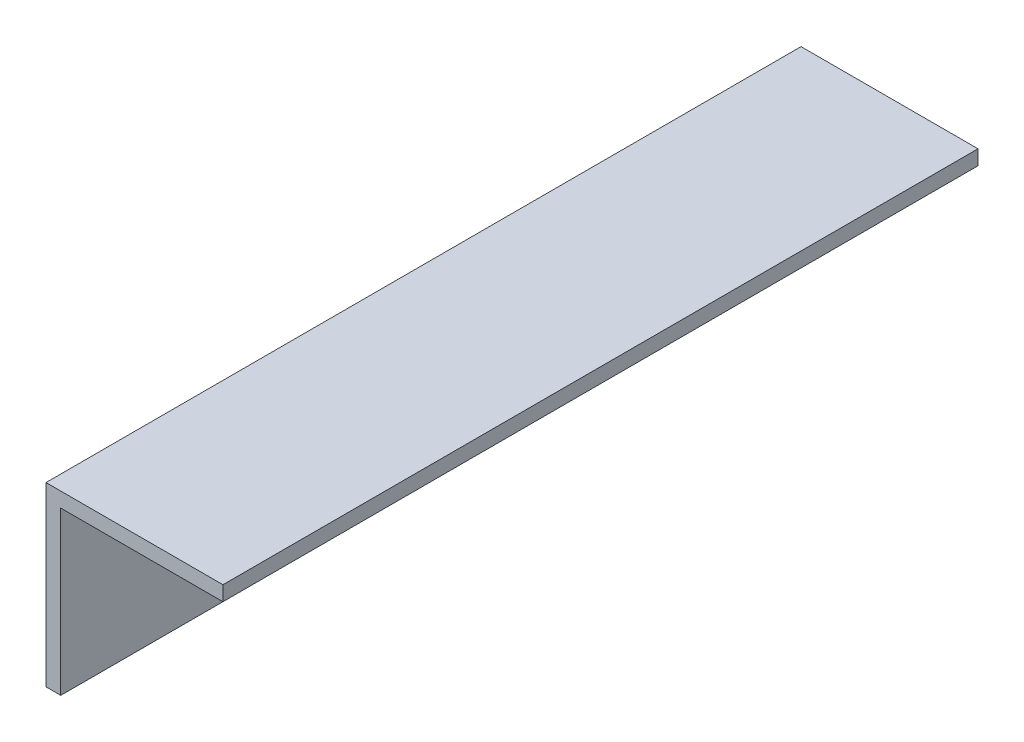
ISO-10303-21;
HEADER;
FILE_DESCRIPTION(('STEP AP214'),'2;1');
FILE_NAME('part.step','',(''),(''),'','','');
FILE_SCHEMA(('AUTOMOTIVE_DESIGN { 1 0 10303 214 1 1 1 1 }'));
ENDSEC;
DATA;
#1=APPLICATION_CONTEXT('core data for automotive mechanical design processes');
#2=APPLICATION_PROTOCOL_DEFINITION('international standard','automotive_design',2000,#1);
#3=PRODUCT_CONTEXT('',#1,'mechanical');
#4=PRODUCT('Part','Part','',(#3));
#5=PRODUCT_RELATED_PRODUCT_CATEGORY('part','',(#4));
#6=PRODUCT_DEFINITION_FORMATION('','',#4);
#7=PRODUCT_DEFINITION_CONTEXT('part definition',#1,'design');
#8=PRODUCT_DEFINITION('design','',#6,#7);
#9=PRODUCT_DEFINITION_SHAPE('','',#8);
#10=(LENGTH_UNIT() NAMED_UNIT(*) SI_UNIT(.MILLI.,.METRE.));
#11=(NAMED_UNIT(*) PLANE_ANGLE_UNIT() SI_UNIT($,.RADIAN.));
#12=(NAMED_UNIT(*) SI_UNIT($,.STERADIAN.) SOLID_ANGLE_UNIT());
#13=UNCERTAINTY_MEASURE_WITH_UNIT(LENGTH_MEASURE(1.E-05),#10,'distance_accuracy_value','');
#14=(GEOMETRIC_REPRESENTATION_CONTEXT(3) GLOBAL_UNCERTAINTY_ASSIGNED_CONTEXT((#13)) GLOBAL_UNIT_ASSIGNED_CONTEXT((#10,
#11,#12)) REPRESENTATION_CONTEXT('',''));
#15=CARTESIAN_POINT('',(0.,0.,0.));
#16=DIRECTION('',(0.,0.,1.));
#17=DIRECTION('',(1.,0.,0.));
#18=AXIS2_PLACEMENT_3D('',#15,#16,#17);
#19=CARTESIAN_POINT('',(1.5875,0.,81.28));
#20=DIRECTION('',(0.,1.,0.));
#21=DIRECTION('',(-1.,0.,0.));
#22=AXIS2_PLACEMENT_3D('',#19,#20,#21);
#23=PLANE('',#22);
#24=DIRECTION('',(1.,0.,0.));
#25=VECTOR('',#24,1.);
#26=CARTESIAN_POINT('',(1.5875,0.,0.));
#27=LINE('',#26,#25);
#28=CARTESIAN_POINT('',(0.,0.,0.));
#29=VERTEX_POINT('',#28);
#30=CARTESIAN_POINT('',(1.5875,0.,0.));
#31=VERTEX_POINT('',#30);
#32=EDGE_CURVE('E120',#29,#31,#27,.T.);
#33=ORIENTED_EDGE('',*,*,#32,.T.);
#34=DIRECTION('',(0.,0.,-1.));
#35=VECTOR('',#34,1.);
#36=CARTESIAN_POINT('',(1.5875,0.,81.28));
#37=LINE('',#36,#35);
#38=CARTESIAN_POINT('',(1.5875,0.,81.28));
#39=VERTEX_POINT('',#38);
#40=EDGE_CURVE('E11',#39,#31,#37,.T.);
#41=ORIENTED_EDGE('',*,*,#40,.F.);
#42=DIRECTION('',(1.,0.,0.));
#43=VECTOR('',#42,1.);
#44=CARTESIAN_POINT('',(1.5875,0.,81.28));
#45=LINE('',#44,#43);
#46=CARTESIAN_POINT('',(0.,0.,81.28));
#47=VERTEX_POINT('',#46);
#48=EDGE_CURVE('E130',#47,#39,#45,.T.);
#49=ORIENTED_EDGE('',*,*,#48,.F.);
#50=DIRECTION('',(0.,0.,-1.));
#51=VECTOR('',#50,1.);
#52=CARTESIAN_POINT('',(0.,0.,81.28));
#53=LINE('',#52,#51);
#54=EDGE_CURVE('E116',#47,#29,#53,.T.);
#55=ORIENTED_EDGE('',*,*,#54,.T.);
#56=EDGE_LOOP('',(#33,#41,#49,#55));
#57=FACE_BOUND('',#56,.T.);
#58=ADVANCED_FACE('F36',(#57),#23,.F.);
#59=CARTESIAN_POINT('',(1.5875,17.4625,81.28));
#60=DIRECTION('',(-1.,0.,0.));
#61=DIRECTION('',(0.,-1.,0.));
#62=AXIS2_PLACEMENT_3D('',#59,#60,#61);
#63=PLANE('',#62);
#64=DIRECTION('',(0.,1.,0.));
#65=VECTOR('',#64,1.);
#66=CARTESIAN_POINT('',(1.5875,17.4625,0.));
#67=LINE('',#66,#65);
#68=CARTESIAN_POINT('',(1.5875,17.4625,0.));
#69=VERTEX_POINT('',#68);
#70=EDGE_CURVE('E123',#31,#69,#67,.T.);
#71=ORIENTED_EDGE('',*,*,#70,.T.);
#72=DIRECTION('',(0.,0.,-1.));
#73=VECTOR('',#72,1.);
#74=CARTESIAN_POINT('',(1.5875,17.4625,81.28));
#75=LINE('',#74,#73);
#76=CARTESIAN_POINT('',(1.5875,17.4625,81.28));
#77=VERTEX_POINT('',#76);
#78=EDGE_CURVE('E44',#77,#69,#75,.T.);
#79=ORIENTED_EDGE('',*,*,#78,.F.);
#80=DIRECTION('',(0.,1.,0.));
#81=VECTOR('',#80,1.);
#82=CARTESIAN_POINT('',(1.5875,17.4625,81.28));
#83=LINE('',#82,#81);
#84=EDGE_CURVE('E89',#39,#77,#83,.T.);
#85=ORIENTED_EDGE('',*,*,#84,.F.);
#86=ORIENTED_EDGE('',*,*,#40,.T.);
#87=EDGE_LOOP('',(#71,#79,#85,#86));
#88=FACE_BOUND('',#87,.T.);
#89=ADVANCED_FACE('F154',(#88),#63,.F.);
#90=CARTESIAN_POINT('',(19.05,17.4625,81.28));
#91=DIRECTION('',(0.,1.,0.));
#92=DIRECTION('',(-1.,0.,0.));
#93=AXIS2_PLACEMENT_3D('',#90,#91,#92);
#94=PLANE('',#93);
#95=DIRECTION('',(1.,0.,0.));
#96=VECTOR('',#95,1.);
#97=CARTESIAN_POINT('',(19.05,17.4625,0.));
#98=LINE('',#97,#96);
#99=CARTESIAN_POINT('',(19.05,17.4625,0.));
#100=VERTEX_POINT('',#99);
#101=EDGE_CURVE('E125',#69,#100,#98,.T.);
#102=ORIENTED_EDGE('',*,*,#101,.T.);
#103=DIRECTION('',(0.,0.,-1.));
#104=VECTOR('',#103,1.);
#105=CARTESIAN_POINT('',(19.05,17.4625,81.28));
#106=LINE('',#105,#104);
#107=CARTESIAN_POINT('',(19.05,17.4625,81.28));
#108=VERTEX_POINT('',#107);
#109=EDGE_CURVE('E111',#108,#100,#106,.T.);
#110=ORIENTED_EDGE('',*,*,#109,.F.);
#111=DIRECTION('',(1.,0.,0.));
#112=VECTOR('',#111,1.);
#113=CARTESIAN_POINT('',(19.05,17.4625,81.28));
#114=LINE('',#113,#112);
#115=EDGE_CURVE('E102',#77,#108,#114,.T.);
#116=ORIENTED_EDGE('',*,*,#115,.F.);
#117=ORIENTED_EDGE('',*,*,#78,.T.);
#118=EDGE_LOOP('',(#102,#110,#116,#117));
#119=FACE_BOUND('',#118,.T.);
#120=ADVANCED_FACE('F136',(#119),#94,.F.);
#121=CARTESIAN_POINT('',(19.05,19.05,81.28));
#122=DIRECTION('',(-1.,0.,0.));
#123=DIRECTION('',(0.,0.,1.));
#124=AXIS2_PLACEMENT_3D('',#121,#122,#123);
#125=PLANE('',#124);
#126=DIRECTION('',(0.,1.,0.));
#127=VECTOR('',#126,1.);
#128=CARTESIAN_POINT('',(19.05,19.05,0.));
#129=LINE('',#128,#127);
#130=CARTESIAN_POINT('',(19.05,19.05,0.));
#131=VERTEX_POINT('',#130);
#132=EDGE_CURVE('E110',#100,#131,#129,.T.);
#133=ORIENTED_EDGE('',*,*,#132,.T.);
#134=DIRECTION('',(0.,0.,-1.));
#135=VECTOR('',#134,1.);
#136=CARTESIAN_POINT('',(19.05,19.05,81.28));
#137=LINE('',#136,#135);
#138=CARTESIAN_POINT('',(19.05,19.05,81.28));
#139=VERTEX_POINT('',#138);
#140=EDGE_CURVE('E107',#139,#131,#137,.T.);
#141=ORIENTED_EDGE('',*,*,#140,.F.);
#142=DIRECTION('',(0.,1.,0.));
#143=VECTOR('',#142,1.);
#144=CARTESIAN_POINT('',(19.05,19.05,81.28));
#145=LINE('',#144,#143);
#146=EDGE_CURVE('E96',#108,#139,#145,.T.);
#147=ORIENTED_EDGE('',*,*,#146,.F.);
#148=ORIENTED_EDGE('',*,*,#109,.T.);
#149=EDGE_LOOP('',(#133,#141,#147,#148));
#150=FACE_BOUND('',#149,.T.);
#151=ADVANCED_FACE('F108',(#150),#125,.F.);
#152=CARTESIAN_POINT('',(0.,19.05,81.28));
#153=DIRECTION('',(0.,-1.,0.));
#154=DIRECTION('',(0.,0.,-1.));
#155=AXIS2_PLACEMENT_3D('',#152,#153,#154);
#156=PLANE('',#155);
#157=DIRECTION('',(-1.,0.,0.));
#158=VECTOR('',#157,1.);
#159=CARTESIAN_POINT('',(0.,19.05,0.));
#160=LINE('',#159,#158);
#161=CARTESIAN_POINT('',(0.,19.05,0.));
#162=VERTEX_POINT('',#161);
#163=EDGE_CURVE('E75',#131,#162,#160,.T.);
#164=ORIENTED_EDGE('',*,*,#163,.T.);
#165=DIRECTION('',(0.,0.,-1.));
#166=VECTOR('',#165,1.);
#167=CARTESIAN_POINT('',(0.,19.05,81.28));
#168=LINE('',#167,#166);
#169=CARTESIAN_POINT('',(0.,19.05,81.28));
#170=VERTEX_POINT('',#169);
#171=EDGE_CURVE('E112',#170,#162,#168,.T.);
#172=ORIENTED_EDGE('',*,*,#171,.F.);
#173=DIRECTION('',(-1.,0.,0.));
#174=VECTOR('',#173,1.);
#175=CARTESIAN_POINT('',(0.,19.05,81.28));
#176=LINE('',#175,#174);
#177=EDGE_CURVE('E100',#139,#170,#176,.T.);
#178=ORIENTED_EDGE('',*,*,#177,.F.);
#179=ORIENTED_EDGE('',*,*,#140,.T.);
#180=EDGE_LOOP('',(#164,#172,#178,#179));
#181=FACE_BOUND('',#180,.T.);
#182=ADVANCED_FACE('F114',(#181),#156,.F.);
#183=CARTESIAN_POINT('',(0.,0.,81.28));
#184=DIRECTION('',(1.,0.,0.));
#185=DIRECTION('',(0.,0.,-1.));
#186=AXIS2_PLACEMENT_3D('',#183,#184,#185);
#187=PLANE('',#186);
#188=DIRECTION('',(0.,-1.,0.));
#189=VECTOR('',#188,1.);
#190=CARTESIAN_POINT('',(0.,0.,0.));
#191=LINE('',#190,#189);
#192=EDGE_CURVE('E81',#162,#29,#191,.T.);
#193=ORIENTED_EDGE('',*,*,#192,.T.);
#194=ORIENTED_EDGE('',*,*,#54,.F.);
#195=DIRECTION('',(0.,-1.,0.));
#196=VECTOR('',#195,1.);
#197=CARTESIAN_POINT('',(0.,0.,81.28));
#198=LINE('',#197,#196);
#199=EDGE_CURVE('E52',#170,#47,#198,.T.);
#200=ORIENTED_EDGE('',*,*,#199,.F.);
#201=ORIENTED_EDGE('',*,*,#171,.T.);
#202=EDGE_LOOP('',(#193,#194,#200,#201));
#203=FACE_BOUND('',#202,.T.);
#204=ADVANCED_FACE('F143',(#203),#187,.F.);
#205=CARTESIAN_POINT('',(0.,0.,81.28));
#206=DIRECTION('',(0.,0.,-1.));
#207=DIRECTION('',(-1.,0.,0.));
#208=AXIS2_PLACEMENT_3D('',#205,#206,#207);
#209=PLANE('',#208);
#210=ORIENTED_EDGE('',*,*,#48,.T.);
#211=ORIENTED_EDGE('',*,*,#84,.T.);
#212=ORIENTED_EDGE('',*,*,#115,.T.);
#213=ORIENTED_EDGE('',*,*,#146,.T.);
#214=ORIENTED_EDGE('',*,*,#177,.T.);
#215=ORIENTED_EDGE('',*,*,#199,.T.);
#216=EDGE_LOOP('',(#210,#211,#212,#213,#214,#215));
#217=FACE_BOUND('',#216,.T.);
#218=ADVANCED_FACE('F98',(#217),#209,.F.);
#219=CARTESIAN_POINT('',(0.,0.,0.));
#220=DIRECTION('',(0.,0.,-1.));
#221=DIRECTION('',(-1.,0.,0.));
#222=AXIS2_PLACEMENT_3D('',#219,#220,#221);
#223=PLANE('',#222);
#224=ORIENTED_EDGE('',*,*,#32,.F.);
#225=ORIENTED_EDGE('',*,*,#192,.F.);
#226=ORIENTED_EDGE('',*,*,#163,.F.);
#227=ORIENTED_EDGE('',*,*,#132,.F.);
#228=ORIENTED_EDGE('',*,*,#101,.F.);
#229=ORIENTED_EDGE('',*,*,#70,.F.);
#230=EDGE_LOOP('',(#224,#225,#226,#227,#228,#229));
#231=FACE_BOUND('',#230,.T.);
#232=ADVANCED_FACE('F139',(#231),#223,.T.);
#233=CLOSED_SHELL('',(#58,#89,#120,#151,#182,#204,#218,#232));
#234=MANIFOLD_SOLID_BREP('B2',#233);
#235=ADVANCED_BREP_SHAPE_REPRESENTATION('',(#18,#234),#14);
#236=SHAPE_DEFINITION_REPRESENTATION(#9,#235);
ENDSEC;
END-ISO-10303-21;
